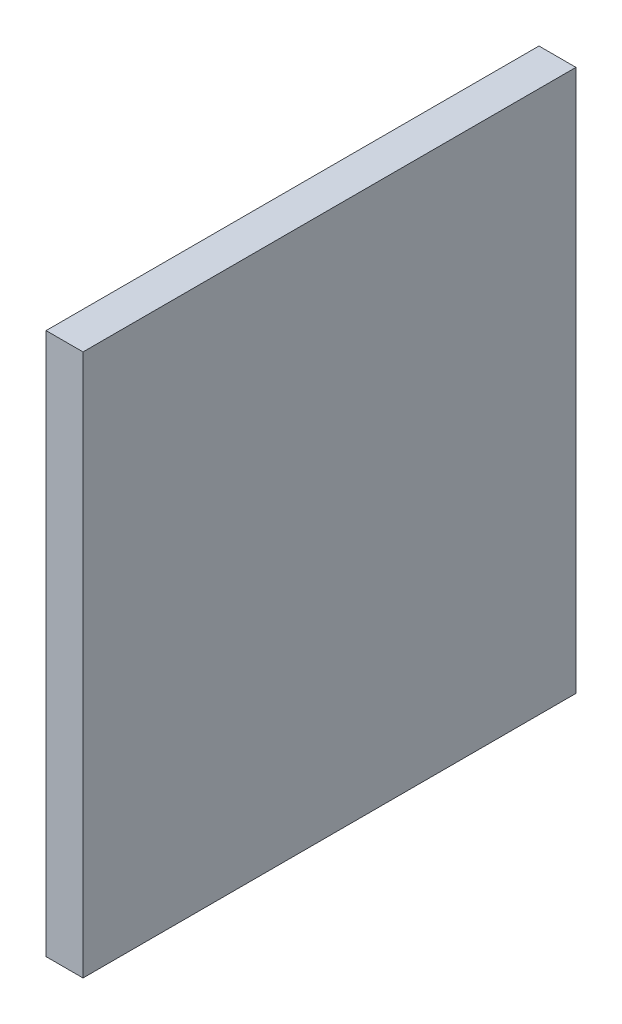
ISO-10303-21;
HEADER;
FILE_DESCRIPTION(('STEP AP214'),'2;1');
FILE_NAME('part.step','',(''),(''),'','','');
FILE_SCHEMA(('AUTOMOTIVE_DESIGN { 1 0 10303 214 1 1 1 1 }'));
ENDSEC;
DATA;
#1=APPLICATION_CONTEXT('core data for automotive mechanical design processes');
#2=APPLICATION_PROTOCOL_DEFINITION('international standard','automotive_design',2000,#1);
#3=PRODUCT_CONTEXT('',#1,'mechanical');
#4=PRODUCT('Part','Part','',(#3));
#5=PRODUCT_RELATED_PRODUCT_CATEGORY('part','',(#4));
#6=PRODUCT_DEFINITION_FORMATION('','',#4);
#7=PRODUCT_DEFINITION_CONTEXT('part definition',#1,'design');
#8=PRODUCT_DEFINITION('design','',#6,#7);
#9=PRODUCT_DEFINITION_SHAPE('','',#8);
#10=(LENGTH_UNIT() NAMED_UNIT(*) SI_UNIT(.MILLI.,.METRE.));
#11=(NAMED_UNIT(*) PLANE_ANGLE_UNIT() SI_UNIT($,.RADIAN.));
#12=(NAMED_UNIT(*) SI_UNIT($,.STERADIAN.) SOLID_ANGLE_UNIT());
#13=UNCERTAINTY_MEASURE_WITH_UNIT(LENGTH_MEASURE(1.E-05),#10,'distance_accuracy_value','');
#14=(GEOMETRIC_REPRESENTATION_CONTEXT(3) GLOBAL_UNCERTAINTY_ASSIGNED_CONTEXT((#13)) GLOBAL_UNIT_ASSIGNED_CONTEXT((#10,
#11,#12)) REPRESENTATION_CONTEXT('',''));
#15=CARTESIAN_POINT('',(0.,0.,0.));
#16=DIRECTION('',(0.,0.,1.));
#17=DIRECTION('',(1.,0.,0.));
#18=AXIS2_PLACEMENT_3D('',#15,#16,#17);
#19=CARTESIAN_POINT('',(-98.3544303797468,-0.0100000000000031,7.15189873417722));
#20=DIRECTION('',(0.,0.,1.));
#21=DIRECTION('',(1.,0.,0.));
#22=AXIS2_PLACEMENT_3D('',#19,#20,#21);
#23=PLANE('',#22);
#24=DIRECTION('',(-1.,0.,0.));
#25=VECTOR('',#24,1.);
#26=CARTESIAN_POINT('',(0.,3.,7.15189873417733));
#27=LINE('',#26,#25);
#28=CARTESIAN_POINT('',(-95.3544303797468,3.,7.15189873417722));
#29=VERTEX_POINT('',#28);
#30=CARTESIAN_POINT('',(-98.3544303797468,3.,7.15189873417722));
#31=VERTEX_POINT('',#30);
#32=EDGE_CURVE('E36',#29,#31,#27,.T.);
#33=ORIENTED_EDGE('',*,*,#32,.F.);
#34=DIRECTION('',(0.,1.,0.));
#35=VECTOR('',#34,1.);
#36=CARTESIAN_POINT('',(-95.3544303797468,-0.0100000000000031,7.15189873417722));
#37=LINE('',#36,#35);
#38=CARTESIAN_POINT('',(-95.3544303797468,47.,7.15189873417722));
#39=VERTEX_POINT('',#38);
#40=EDGE_CURVE('E93',#29,#39,#37,.T.);
#41=ORIENTED_EDGE('',*,*,#40,.T.);
#42=DIRECTION('',(1.,0.,0.));
#43=VECTOR('',#42,1.);
#44=CARTESIAN_POINT('',(0.,47.,7.15189873417733));
#45=LINE('',#44,#43);
#46=CARTESIAN_POINT('',(-98.3544303797468,47.,7.15189873417722));
#47=VERTEX_POINT('',#46);
#48=EDGE_CURVE('E88',#47,#39,#45,.T.);
#49=ORIENTED_EDGE('',*,*,#48,.F.);
#50=DIRECTION('',(0.,-1.,0.));
#51=VECTOR('',#50,1.);
#52=CARTESIAN_POINT('',(-98.3544303797468,50.,7.15189873417722));
#53=LINE('',#52,#51);
#54=EDGE_CURVE('E79',#47,#31,#53,.T.);
#55=ORIENTED_EDGE('',*,*,#54,.T.);
#56=EDGE_LOOP('',(#33,#41,#49,#55));
#57=FACE_BOUND('',#56,.T.);
#58=ADVANCED_FACE('F32',(#57),#23,.T.);
#59=CARTESIAN_POINT('',(-98.3544303797468,-0.0100000000000031,-32.8481012658228));
#60=DIRECTION('',(0.,0.,-1.));
#61=DIRECTION('',(-1.,0.,0.));
#62=AXIS2_PLACEMENT_3D('',#59,#60,#61);
#63=PLANE('',#62);
#64=DIRECTION('',(1.,0.,0.));
#65=VECTOR('',#64,1.);
#66=CARTESIAN_POINT('',(0.,3.,-32.8481012658228));
#67=LINE('',#66,#65);
#68=CARTESIAN_POINT('',(-98.3544303797468,3.,-32.8481012658228));
#69=VERTEX_POINT('',#68);
#70=CARTESIAN_POINT('',(-95.3544303797468,3.,-32.8481012658228));
#71=VERTEX_POINT('',#70);
#72=EDGE_CURVE('E91',#69,#71,#67,.T.);
#73=ORIENTED_EDGE('',*,*,#72,.F.);
#74=DIRECTION('',(0.,1.,0.));
#75=VECTOR('',#74,1.);
#76=CARTESIAN_POINT('',(-98.3544303797468,50.,-32.8481012658228));
#77=LINE('',#76,#75);
#78=CARTESIAN_POINT('',(-98.3544303797468,47.,-32.8481012658228));
#79=VERTEX_POINT('',#78);
#80=EDGE_CURVE('E77',#69,#79,#77,.T.);
#81=ORIENTED_EDGE('',*,*,#80,.T.);
#82=DIRECTION('',(-1.,0.,0.));
#83=VECTOR('',#82,1.);
#84=CARTESIAN_POINT('',(0.,47.,-32.8481012658228));
#85=LINE('',#84,#83);
#86=CARTESIAN_POINT('',(-95.3544303797468,47.,-32.8481012658228));
#87=VERTEX_POINT('',#86);
#88=EDGE_CURVE('E86',#87,#79,#85,.T.);
#89=ORIENTED_EDGE('',*,*,#88,.F.);
#90=DIRECTION('',(0.,1.,0.));
#91=VECTOR('',#90,1.);
#92=CARTESIAN_POINT('',(-95.3544303797468,47.,-32.8481012658228));
#93=LINE('',#92,#91);
#94=EDGE_CURVE('E49',#71,#87,#93,.T.);
#95=ORIENTED_EDGE('',*,*,#94,.F.);
#96=EDGE_LOOP('',(#73,#81,#89,#95));
#97=FACE_BOUND('',#96,.T.);
#98=ADVANCED_FACE('F90',(#97),#63,.T.);
#99=CARTESIAN_POINT('',(-98.3544303797468,50.,-47.8481012658228));
#100=DIRECTION('',(1.,0.,0.));
#101=DIRECTION('',(0.,0.,-1.));
#102=AXIS2_PLACEMENT_3D('',#99,#100,#101);
#103=PLANE('',#102);
#104=ORIENTED_EDGE('',*,*,#54,.F.);
#105=DIRECTION('',(0.,0.,1.));
#106=VECTOR('',#105,1.);
#107=CARTESIAN_POINT('',(-98.3544303797468,47.,-47.8481012658228));
#108=LINE('',#107,#106);
#109=EDGE_CURVE('E73',#79,#47,#108,.T.);
#110=ORIENTED_EDGE('',*,*,#109,.F.);
#111=ORIENTED_EDGE('',*,*,#80,.F.);
#112=DIRECTION('',(0.,0.,-1.));
#113=VECTOR('',#112,1.);
#114=CARTESIAN_POINT('',(-98.3544303797468,3.,-47.8481012658228));
#115=LINE('',#114,#113);
#116=EDGE_CURVE('E41',#31,#69,#115,.T.);
#117=ORIENTED_EDGE('',*,*,#116,.F.);
#118=EDGE_LOOP('',(#104,#110,#111,#117));
#119=FACE_BOUND('',#118,.T.);
#120=ADVANCED_FACE('F75',(#119),#103,.F.);
#121=CARTESIAN_POINT('',(0.,47.,0.));
#122=DIRECTION('',(0.,1.,0.));
#123=DIRECTION('',(0.,0.,1.));
#124=AXIS2_PLACEMENT_3D('',#121,#122,#123);
#125=PLANE('',#124);
#126=ORIENTED_EDGE('',*,*,#109,.T.);
#127=ORIENTED_EDGE('',*,*,#48,.T.);
#128=DIRECTION('',(0.,0.,1.));
#129=VECTOR('',#128,1.);
#130=CARTESIAN_POINT('',(-95.3544303797468,47.,-47.8481012658228));
#131=LINE('',#130,#129);
#132=EDGE_CURVE('E83',#87,#39,#131,.T.);
#133=ORIENTED_EDGE('',*,*,#132,.F.);
#134=ORIENTED_EDGE('',*,*,#88,.T.);
#135=EDGE_LOOP('',(#126,#127,#133,#134));
#136=FACE_BOUND('',#135,.T.);
#137=ADVANCED_FACE('F87',(#136),#125,.T.);
#138=CARTESIAN_POINT('',(0.,3.,0.));
#139=DIRECTION('',(0.,-1.,0.));
#140=DIRECTION('',(0.,0.,-1.));
#141=AXIS2_PLACEMENT_3D('',#138,#139,#140);
#142=PLANE('',#141);
#143=DIRECTION('',(0.,0.,1.));
#144=VECTOR('',#143,1.);
#145=CARTESIAN_POINT('',(-95.3544303797468,3.,-47.8481012658228));
#146=LINE('',#145,#144);
#147=EDGE_CURVE('E11',#71,#29,#146,.T.);
#148=ORIENTED_EDGE('',*,*,#147,.T.);
#149=ORIENTED_EDGE('',*,*,#32,.T.);
#150=ORIENTED_EDGE('',*,*,#116,.T.);
#151=ORIENTED_EDGE('',*,*,#72,.T.);
#152=EDGE_LOOP('',(#148,#149,#150,#151));
#153=FACE_BOUND('',#152,.T.);
#154=ADVANCED_FACE('F106',(#153),#142,.T.);
#155=CARTESIAN_POINT('',(-95.3544303797468,47.,-47.8481012658228));
#156=DIRECTION('',(1.,0.,0.));
#157=DIRECTION('',(0.,0.,-1.));
#158=AXIS2_PLACEMENT_3D('',#155,#156,#157);
#159=PLANE('',#158);
#160=ORIENTED_EDGE('',*,*,#40,.F.);
#161=ORIENTED_EDGE('',*,*,#147,.F.);
#162=ORIENTED_EDGE('',*,*,#94,.T.);
#163=ORIENTED_EDGE('',*,*,#132,.T.);
#164=EDGE_LOOP('',(#160,#161,#162,#163));
#165=FACE_BOUND('',#164,.T.);
#166=ADVANCED_FACE('F34',(#165),#159,.T.);
#167=CLOSED_SHELL('',(#58,#98,#120,#137,#154,#166));
#168=MANIFOLD_SOLID_BREP('B2',#167);
#169=ADVANCED_BREP_SHAPE_REPRESENTATION('',(#18,#168),#14);
#170=SHAPE_DEFINITION_REPRESENTATION(#9,#169);
ENDSEC;
END-ISO-10303-21;
